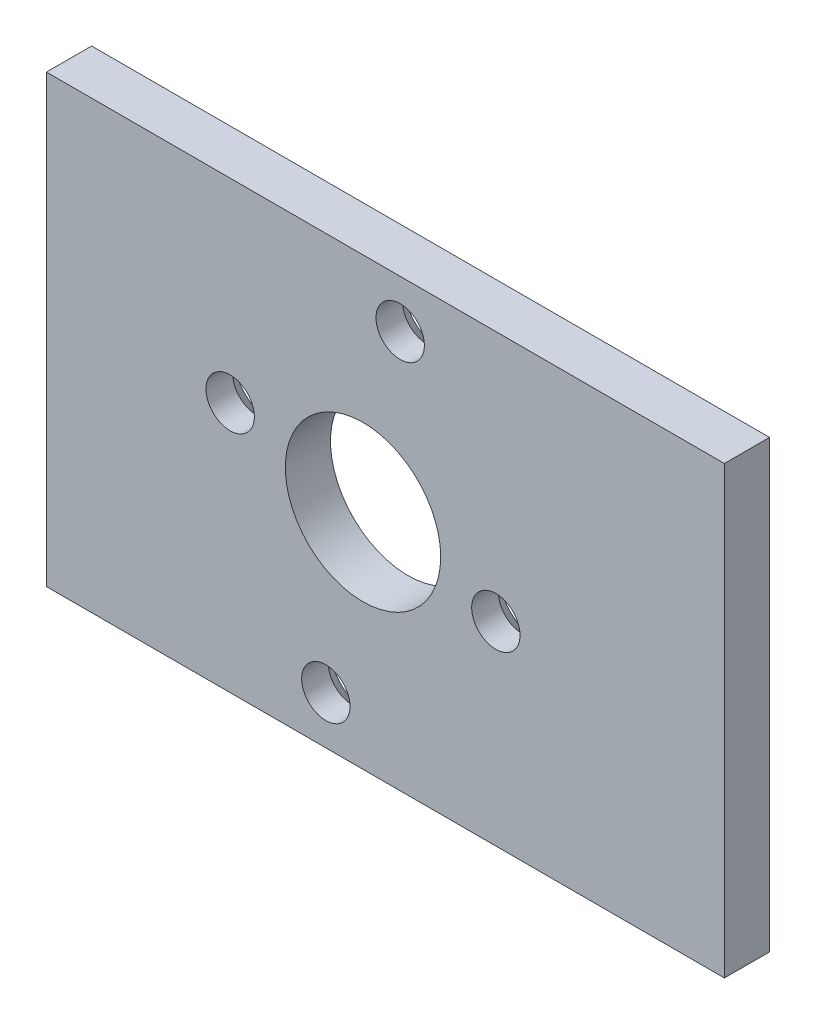
ISO-10303-21;
HEADER;
FILE_DESCRIPTION(('STEP AP214'),'2;1');
FILE_NAME('part.step','',(''),(''),'','','');
FILE_SCHEMA(('AUTOMOTIVE_DESIGN { 1 0 10303 214 1 1 1 1 }'));
ENDSEC;
DATA;
#1=APPLICATION_CONTEXT('core data for automotive mechanical design processes');
#2=APPLICATION_PROTOCOL_DEFINITION('international standard','automotive_design',2000,#1);
#3=PRODUCT_CONTEXT('',#1,'mechanical');
#4=PRODUCT('Part','Part','',(#3));
#5=PRODUCT_RELATED_PRODUCT_CATEGORY('part','',(#4));
#6=PRODUCT_DEFINITION_FORMATION('','',#4);
#7=PRODUCT_DEFINITION_CONTEXT('part definition',#1,'design');
#8=PRODUCT_DEFINITION('design','',#6,#7);
#9=PRODUCT_DEFINITION_SHAPE('','',#8);
#10=(LENGTH_UNIT() NAMED_UNIT(*) SI_UNIT(.MILLI.,.METRE.));
#11=(NAMED_UNIT(*) PLANE_ANGLE_UNIT() SI_UNIT($,.RADIAN.));
#12=(NAMED_UNIT(*) SI_UNIT($,.STERADIAN.) SOLID_ANGLE_UNIT());
#13=UNCERTAINTY_MEASURE_WITH_UNIT(LENGTH_MEASURE(1.E-05),#10,'distance_accuracy_value','');
#14=(GEOMETRIC_REPRESENTATION_CONTEXT(3) GLOBAL_UNCERTAINTY_ASSIGNED_CONTEXT((#13)) GLOBAL_UNIT_ASSIGNED_CONTEXT((#10,
#11,#12)) REPRESENTATION_CONTEXT('',''));
#15=CARTESIAN_POINT('',(0.,0.,0.));
#16=DIRECTION('',(0.,0.,1.));
#17=DIRECTION('',(1.,0.,0.));
#18=AXIS2_PLACEMENT_3D('',#15,#16,#17);
#19=CARTESIAN_POINT('',(25.4,15.6591,3.175));
#20=DIRECTION('',(0.,0.,-1.));
#21=DIRECTION('',(-1.,0.,0.));
#22=AXIS2_PLACEMENT_3D('',#19,#20,#21);
#23=PLANE('',#22);
#24=CARTESIAN_POINT('',(2.61344995357919,12.2953153412239,3.175));
#25=DIRECTION('',(0.,0.,1.));
#26=DIRECTION('',(1.,0.,0.));
#27=AXIS2_PLACEMENT_3D('',#24,#25,#26);
#28=CIRCLE('',#27,1.7);
#29=CARTESIAN_POINT('',(4.31344995357919,12.2953153412239,3.175));
#30=VERTEX_POINT('',#29);
#31=EDGE_CURVE('E155',#30,#30,#28,.T.);
#32=ORIENTED_EDGE('',*,*,#31,.F.);
#33=EDGE_LOOP('',(#32));
#34=FACE_BOUND('',#33,.T.);
#35=CARTESIAN_POINT('',(-9.33641884900418,1.98451708885548,3.175));
#36=DIRECTION('',(0.,0.,1.));
#37=DIRECTION('',(1.,0.,0.));
#38=AXIS2_PLACEMENT_3D('',#35,#36,#37);
#39=CIRCLE('',#38,1.7);
#40=CARTESIAN_POINT('',(-7.63641884900418,1.98451708885548,3.175));
#41=VERTEX_POINT('',#40);
#42=EDGE_CURVE('E158',#41,#41,#39,.T.);
#43=ORIENTED_EDGE('',*,*,#42,.F.);
#44=EDGE_LOOP('',(#43));
#45=FACE_BOUND('',#44,.T.);
#46=DIRECTION('',(0.,1.,0.));
#47=VECTOR('',#46,1.);
#48=CARTESIAN_POINT('',(25.4,-15.6591,3.175));
#49=LINE('',#48,#47);
#50=CARTESIAN_POINT('',(25.4,-15.6591,3.175));
#51=VERTEX_POINT('',#50);
#52=CARTESIAN_POINT('',(25.4,15.6591,3.175));
#53=VERTEX_POINT('',#52);
#54=EDGE_CURVE('E86',#51,#53,#49,.T.);
#55=ORIENTED_EDGE('',*,*,#54,.T.);
#56=DIRECTION('',(-1.,0.,0.));
#57=VECTOR('',#56,1.);
#58=CARTESIAN_POINT('',(-22.2504,15.6591,3.175));
#59=LINE('',#58,#57);
#60=CARTESIAN_POINT('',(-22.2504,15.6591,3.175));
#61=VERTEX_POINT('',#60);
#62=EDGE_CURVE('E81',#53,#61,#59,.T.);
#63=ORIENTED_EDGE('',*,*,#62,.T.);
#64=DIRECTION('',(0.,-1.,0.));
#65=VECTOR('',#64,1.);
#66=CARTESIAN_POINT('',(-22.2504,15.6591,3.175));
#67=LINE('',#66,#65);
#68=CARTESIAN_POINT('',(-22.2504,-15.6591,3.175));
#69=VERTEX_POINT('',#68);
#70=EDGE_CURVE('E84',#61,#69,#67,.T.);
#71=ORIENTED_EDGE('',*,*,#70,.T.);
#72=DIRECTION('',(1.,0.,0.));
#73=VECTOR('',#72,1.);
#74=CARTESIAN_POINT('',(-22.2504,-15.6591,3.175));
#75=LINE('',#74,#73);
#76=EDGE_CURVE('E50',#69,#51,#75,.T.);
#77=ORIENTED_EDGE('',*,*,#76,.T.);
#78=EDGE_LOOP('',(#55,#63,#71,#77));
#79=FACE_BOUND('',#78,.T.);
#80=CARTESIAN_POINT('',(9.33641884900418,-1.98451708885548,3.175));
#81=DIRECTION('',(0.,0.,1.));
#82=DIRECTION('',(1.,0.,0.));
#83=AXIS2_PLACEMENT_3D('',#80,#81,#82);
#84=CIRCLE('',#83,1.7);
#85=CARTESIAN_POINT('',(11.0364188490042,-1.98451708885548,3.175));
#86=VERTEX_POINT('',#85);
#87=EDGE_CURVE('E104',#86,#86,#84,.T.);
#88=ORIENTED_EDGE('',*,*,#87,.F.);
#89=EDGE_LOOP('',(#88));
#90=FACE_BOUND('',#89,.T.);
#91=CARTESIAN_POINT('',(0.,0.,3.175));
#92=DIRECTION('',(0.,0.,1.));
#93=DIRECTION('',(1.,0.,0.));
#94=AXIS2_PLACEMENT_3D('',#91,#92,#93);
#95=CIRCLE('',#94,5.461);
#96=CARTESIAN_POINT('',(5.461,0.,3.175));
#97=VERTEX_POINT('',#96);
#98=EDGE_CURVE('E154',#97,#97,#95,.T.);
#99=ORIENTED_EDGE('',*,*,#98,.F.);
#100=EDGE_LOOP('',(#99));
#101=FACE_BOUND('',#100,.T.);
#102=CARTESIAN_POINT('',(-2.61344995357919,-12.2953153412239,3.175));
#103=DIRECTION('',(0.,0.,1.));
#104=DIRECTION('',(1.,0.,0.));
#105=AXIS2_PLACEMENT_3D('',#102,#103,#104);
#106=CIRCLE('',#105,1.7);
#107=CARTESIAN_POINT('',(-0.913449953579191,-12.2953153412239,3.175));
#108=VERTEX_POINT('',#107);
#109=EDGE_CURVE('E161',#108,#108,#106,.T.);
#110=ORIENTED_EDGE('',*,*,#109,.F.);
#111=EDGE_LOOP('',(#110));
#112=FACE_BOUND('',#111,.T.);
#113=ADVANCED_FACE('F33',(#34,#45,#79,#90,#101,#112),#23,.F.);
#114=CARTESIAN_POINT('',(25.4,15.6591,0.));
#115=DIRECTION('',(0.,0.,-1.));
#116=DIRECTION('',(-1.,0.,0.));
#117=AXIS2_PLACEMENT_3D('',#114,#115,#116);
#118=PLANE('',#117);
#119=CARTESIAN_POINT('',(9.33641884900418,-1.98451708885548,0.));
#120=DIRECTION('',(0.,0.,-1.));
#121=DIRECTION('',(-1.,0.,0.));
#122=AXIS2_PLACEMENT_3D('',#119,#120,#121);
#123=CIRCLE('',#122,2.99999994);
#124=CARTESIAN_POINT('',(6.33641890900419,-1.98451708885548,0.));
#125=VERTEX_POINT('',#124);
#126=EDGE_CURVE('E120',#125,#125,#123,.F.);
#127=ORIENTED_EDGE('',*,*,#126,.T.);
#128=EDGE_LOOP('',(#127));
#129=FACE_BOUND('',#128,.T.);
#130=CARTESIAN_POINT('',(2.61344995357919,12.2953153412239,0.));
#131=DIRECTION('',(0.,0.,-1.));
#132=DIRECTION('',(-1.,0.,0.));
#133=AXIS2_PLACEMENT_3D('',#130,#131,#132);
#134=CIRCLE('',#133,2.99999993999999);
#135=CARTESIAN_POINT('',(-0.386549986420802,12.2953153412239,0.));
#136=VERTEX_POINT('',#135);
#137=EDGE_CURVE('E117',#136,#136,#134,.F.);
#138=ORIENTED_EDGE('',*,*,#137,.T.);
#139=EDGE_LOOP('',(#138));
#140=FACE_BOUND('',#139,.T.);
#141=CARTESIAN_POINT('',(-9.33641884900418,1.98451708885548,0.));
#142=DIRECTION('',(0.,0.,-1.));
#143=DIRECTION('',(-1.,0.,0.));
#144=AXIS2_PLACEMENT_3D('',#141,#142,#143);
#145=CIRCLE('',#144,2.99999994000002);
#146=CARTESIAN_POINT('',(-12.3364187890042,1.98451708885548,0.));
#147=VERTEX_POINT('',#146);
#148=EDGE_CURVE('E114',#147,#147,#145,.F.);
#149=ORIENTED_EDGE('',*,*,#148,.T.);
#150=EDGE_LOOP('',(#149));
#151=FACE_BOUND('',#150,.T.);
#152=CARTESIAN_POINT('',(-2.61344995357919,-12.2953153412239,0.));
#153=DIRECTION('',(0.,0.,-1.));
#154=DIRECTION('',(-1.,0.,0.));
#155=AXIS2_PLACEMENT_3D('',#152,#153,#154);
#156=CIRCLE('',#155,2.99999994);
#157=CARTESIAN_POINT('',(-5.61344989357919,-12.2953153412239,0.));
#158=VERTEX_POINT('',#157);
#159=EDGE_CURVE('E111',#158,#158,#156,.F.);
#160=ORIENTED_EDGE('',*,*,#159,.T.);
#161=EDGE_LOOP('',(#160));
#162=FACE_BOUND('',#161,.T.);
#163=DIRECTION('',(0.,1.,0.));
#164=VECTOR('',#163,1.);
#165=CARTESIAN_POINT('',(25.4,-15.6591,0.));
#166=LINE('',#165,#164);
#167=CARTESIAN_POINT('',(25.4,-15.6591,0.));
#168=VERTEX_POINT('',#167);
#169=CARTESIAN_POINT('',(25.4,15.6591,0.));
#170=VERTEX_POINT('',#169);
#171=EDGE_CURVE('E101',#168,#170,#166,.T.);
#172=ORIENTED_EDGE('',*,*,#171,.F.);
#173=DIRECTION('',(1.,0.,0.));
#174=VECTOR('',#173,1.);
#175=CARTESIAN_POINT('',(-22.2504,-15.6591,0.));
#176=LINE('',#175,#174);
#177=CARTESIAN_POINT('',(-22.2504,-15.6591,0.));
#178=VERTEX_POINT('',#177);
#179=EDGE_CURVE('E73',#178,#168,#176,.T.);
#180=ORIENTED_EDGE('',*,*,#179,.F.);
#181=DIRECTION('',(0.,-1.,0.));
#182=VECTOR('',#181,1.);
#183=CARTESIAN_POINT('',(-22.2504,15.6591,0.));
#184=LINE('',#183,#182);
#185=CARTESIAN_POINT('',(-22.2504,15.6591,0.));
#186=VERTEX_POINT('',#185);
#187=EDGE_CURVE('E67',#186,#178,#184,.T.);
#188=ORIENTED_EDGE('',*,*,#187,.F.);
#189=DIRECTION('',(-1.,0.,0.));
#190=VECTOR('',#189,1.);
#191=CARTESIAN_POINT('',(-22.2504,15.6591,0.));
#192=LINE('',#191,#190);
#193=EDGE_CURVE('E91',#170,#186,#192,.T.);
#194=ORIENTED_EDGE('',*,*,#193,.F.);
#195=EDGE_LOOP('',(#172,#180,#188,#194));
#196=FACE_BOUND('',#195,.T.);
#197=CARTESIAN_POINT('',(0.,0.,0.));
#198=DIRECTION('',(0.,0.,1.));
#199=DIRECTION('',(1.,0.,0.));
#200=AXIS2_PLACEMENT_3D('',#197,#198,#199);
#201=CIRCLE('',#200,5.461);
#202=CARTESIAN_POINT('',(5.461,0.,0.));
#203=VERTEX_POINT('',#202);
#204=EDGE_CURVE('E152',#203,#203,#201,.T.);
#205=ORIENTED_EDGE('',*,*,#204,.T.);
#206=EDGE_LOOP('',(#205));
#207=FACE_BOUND('',#206,.T.);
#208=ADVANCED_FACE('F140',(#129,#140,#151,#162,#196,#207),#118,.T.);
#209=CARTESIAN_POINT('',(25.4,-15.6591,3.175));
#210=DIRECTION('',(-1.,0.,0.));
#211=DIRECTION('',(0.,0.,1.));
#212=AXIS2_PLACEMENT_3D('',#209,#210,#211);
#213=PLANE('',#212);
#214=ORIENTED_EDGE('',*,*,#171,.T.);
#215=DIRECTION('',(0.,0.,-1.));
#216=VECTOR('',#215,1.);
#217=CARTESIAN_POINT('',(25.4,15.6591,3.175));
#218=LINE('',#217,#216);
#219=EDGE_CURVE('E92',#53,#170,#218,.T.);
#220=ORIENTED_EDGE('',*,*,#219,.F.);
#221=ORIENTED_EDGE('',*,*,#54,.F.);
#222=DIRECTION('',(0.,0.,-1.));
#223=VECTOR('',#222,1.);
#224=CARTESIAN_POINT('',(25.4,-15.6591,3.175));
#225=LINE('',#224,#223);
#226=EDGE_CURVE('E97',#51,#168,#225,.T.);
#227=ORIENTED_EDGE('',*,*,#226,.T.);
#228=EDGE_LOOP('',(#214,#220,#221,#227));
#229=FACE_BOUND('',#228,.T.);
#230=ADVANCED_FACE('F143',(#229),#213,.F.);
#231=CARTESIAN_POINT('',(-22.2504,15.6591,3.175));
#232=DIRECTION('',(0.,-1.,0.));
#233=DIRECTION('',(0.,0.,-1.));
#234=AXIS2_PLACEMENT_3D('',#231,#232,#233);
#235=PLANE('',#234);
#236=ORIENTED_EDGE('',*,*,#193,.T.);
#237=DIRECTION('',(0.,0.,-1.));
#238=VECTOR('',#237,1.);
#239=CARTESIAN_POINT('',(-22.2504,15.6591,3.175));
#240=LINE('',#239,#238);
#241=EDGE_CURVE('E89',#61,#186,#240,.T.);
#242=ORIENTED_EDGE('',*,*,#241,.F.);
#243=ORIENTED_EDGE('',*,*,#62,.F.);
#244=ORIENTED_EDGE('',*,*,#219,.T.);
#245=EDGE_LOOP('',(#236,#242,#243,#244));
#246=FACE_BOUND('',#245,.T.);
#247=ADVANCED_FACE('F90',(#246),#235,.F.);
#248=CARTESIAN_POINT('',(-22.2504,15.6591,3.175));
#249=DIRECTION('',(1.,0.,0.));
#250=DIRECTION('',(0.,1.,0.));
#251=AXIS2_PLACEMENT_3D('',#248,#249,#250);
#252=PLANE('',#251);
#253=ORIENTED_EDGE('',*,*,#187,.T.);
#254=DIRECTION('',(0.,0.,-1.));
#255=VECTOR('',#254,1.);
#256=CARTESIAN_POINT('',(-22.2504,-15.6591,3.175));
#257=LINE('',#256,#255);
#258=EDGE_CURVE('E93',#69,#178,#257,.T.);
#259=ORIENTED_EDGE('',*,*,#258,.F.);
#260=ORIENTED_EDGE('',*,*,#70,.F.);
#261=ORIENTED_EDGE('',*,*,#241,.T.);
#262=EDGE_LOOP('',(#253,#259,#260,#261));
#263=FACE_BOUND('',#262,.T.);
#264=ADVANCED_FACE('F95',(#263),#252,.F.);
#265=CARTESIAN_POINT('',(-22.2504,-15.6591,3.175));
#266=DIRECTION('',(0.,1.,0.));
#267=DIRECTION('',(0.,0.,1.));
#268=AXIS2_PLACEMENT_3D('',#265,#266,#267);
#269=PLANE('',#268);
#270=ORIENTED_EDGE('',*,*,#179,.T.);
#271=ORIENTED_EDGE('',*,*,#226,.F.);
#272=ORIENTED_EDGE('',*,*,#76,.F.);
#273=ORIENTED_EDGE('',*,*,#258,.T.);
#274=EDGE_LOOP('',(#270,#271,#272,#273));
#275=FACE_BOUND('',#274,.T.);
#276=ADVANCED_FACE('F202',(#275),#269,.F.);
#277=CARTESIAN_POINT('',(9.33641884900418,-1.98451708885548,3.175));
#278=DIRECTION('',(0.,0.,-1.));
#279=DIRECTION('',(-1.,0.,0.));
#280=AXIS2_PLACEMENT_3D('',#277,#278,#279);
#281=CYLINDRICAL_SURFACE('',#280,1.7);
#282=CARTESIAN_POINT('',(9.33641884900418,-1.98451708885548,1.29999994000001));
#283=DIRECTION('',(0.,0.,-1.));
#284=DIRECTION('',(-1.,0.,0.));
#285=AXIS2_PLACEMENT_3D('',#282,#283,#284);
#286=CIRCLE('',#285,1.7);
#287=CARTESIAN_POINT('',(7.63641884900418,-1.98451708885548,1.29999994000001));
#288=VERTEX_POINT('',#287);
#289=EDGE_CURVE('E123',#288,#288,#286,.T.);
#290=ORIENTED_EDGE('',*,*,#289,.T.);
#291=EDGE_LOOP('',(#290));
#292=FACE_BOUND('',#291,.T.);
#293=ORIENTED_EDGE('',*,*,#87,.T.);
#294=EDGE_LOOP('',(#293));
#295=FACE_BOUND('',#294,.T.);
#296=ADVANCED_FACE('F169',(#292,#295),#281,.F.);
#297=CARTESIAN_POINT('',(-9.33641884900418,1.98451708885548,3.175));
#298=DIRECTION('',(0.,0.,-1.));
#299=DIRECTION('',(-1.,0.,0.));
#300=AXIS2_PLACEMENT_3D('',#297,#298,#299);
#301=CYLINDRICAL_SURFACE('',#300,1.7);
#302=CARTESIAN_POINT('',(-9.33641884900418,1.98451708885548,1.29999994000002));
#303=DIRECTION('',(0.,0.,-1.));
#304=DIRECTION('',(-1.,0.,0.));
#305=AXIS2_PLACEMENT_3D('',#302,#303,#304);
#306=CIRCLE('',#305,1.7);
#307=CARTESIAN_POINT('',(-11.0364188490042,1.98451708885548,1.29999994000002));
#308=VERTEX_POINT('',#307);
#309=EDGE_CURVE('E42',#308,#308,#306,.T.);
#310=ORIENTED_EDGE('',*,*,#309,.T.);
#311=EDGE_LOOP('',(#310));
#312=FACE_BOUND('',#311,.T.);
#313=ORIENTED_EDGE('',*,*,#42,.T.);
#314=EDGE_LOOP('',(#313));
#315=FACE_BOUND('',#314,.T.);
#316=ADVANCED_FACE('F131',(#312,#315),#301,.F.);
#317=CARTESIAN_POINT('',(0.,0.,3.175));
#318=DIRECTION('',(0.,0.,-1.));
#319=DIRECTION('',(-1.,0.,0.));
#320=AXIS2_PLACEMENT_3D('',#317,#318,#319);
#321=CYLINDRICAL_SURFACE('',#320,5.461);
#322=ORIENTED_EDGE('',*,*,#98,.T.);
#323=EDGE_LOOP('',(#322));
#324=FACE_BOUND('',#323,.T.);
#325=ORIENTED_EDGE('',*,*,#204,.F.);
#326=EDGE_LOOP('',(#325));
#327=FACE_BOUND('',#326,.T.);
#328=ADVANCED_FACE('F192',(#324,#327),#321,.F.);
#329=CARTESIAN_POINT('',(2.61344995357919,12.2953153412239,3.175));
#330=DIRECTION('',(0.,0.,-1.));
#331=DIRECTION('',(-1.,0.,0.));
#332=AXIS2_PLACEMENT_3D('',#329,#330,#331);
#333=CYLINDRICAL_SURFACE('',#332,1.7);
#334=CARTESIAN_POINT('',(2.61344995357919,12.2953153412239,1.29999994));
#335=DIRECTION('',(0.,0.,-1.));
#336=DIRECTION('',(-1.,0.,0.));
#337=AXIS2_PLACEMENT_3D('',#334,#335,#336);
#338=CIRCLE('',#337,1.7);
#339=CARTESIAN_POINT('',(0.913449953579189,12.2953153412239,1.29999994));
#340=VERTEX_POINT('',#339);
#341=EDGE_CURVE('E126',#340,#340,#338,.T.);
#342=ORIENTED_EDGE('',*,*,#341,.T.);
#343=EDGE_LOOP('',(#342));
#344=FACE_BOUND('',#343,.T.);
#345=ORIENTED_EDGE('',*,*,#31,.T.);
#346=EDGE_LOOP('',(#345));
#347=FACE_BOUND('',#346,.T.);
#348=ADVANCED_FACE('F183',(#344,#347),#333,.F.);
#349=CARTESIAN_POINT('',(-2.61344995357919,-12.2953153412239,3.175));
#350=DIRECTION('',(0.,0.,-1.));
#351=DIRECTION('',(-1.,0.,0.));
#352=AXIS2_PLACEMENT_3D('',#349,#350,#351);
#353=CYLINDRICAL_SURFACE('',#352,1.7);
#354=CARTESIAN_POINT('',(-2.61344995357919,-12.2953153412239,1.29999994));
#355=DIRECTION('',(0.,0.,-1.));
#356=DIRECTION('',(-1.,0.,0.));
#357=AXIS2_PLACEMENT_3D('',#354,#355,#356);
#358=CIRCLE('',#357,1.7);
#359=CARTESIAN_POINT('',(-4.31344995357919,-12.2953153412239,1.29999994));
#360=VERTEX_POINT('',#359);
#361=EDGE_CURVE('E11',#360,#360,#358,.T.);
#362=ORIENTED_EDGE('',*,*,#361,.T.);
#363=EDGE_LOOP('',(#362));
#364=FACE_BOUND('',#363,.T.);
#365=ORIENTED_EDGE('',*,*,#109,.T.);
#366=EDGE_LOOP('',(#365));
#367=FACE_BOUND('',#366,.T.);
#368=ADVANCED_FACE('F180',(#364,#367),#353,.F.);
#369=CARTESIAN_POINT('',(9.33641884900418,-1.98451708885548,0.));
#370=DIRECTION('',(0.,0.,-1.));
#371=DIRECTION('',(-1.,0.,0.));
#372=AXIS2_PLACEMENT_3D('',#369,#370,#371);
#373=CONICAL_SURFACE('',#372,2.99999994,0.785398163397445);
#374=ORIENTED_EDGE('',*,*,#289,.F.);
#375=EDGE_LOOP('',(#374));
#376=FACE_BOUND('',#375,.T.);
#377=ORIENTED_EDGE('',*,*,#126,.F.);
#378=EDGE_LOOP('',(#377));
#379=FACE_BOUND('',#378,.T.);
#380=ADVANCED_FACE('F182',(#376,#379),#373,.F.);
#381=CARTESIAN_POINT('',(2.61344995357919,12.2953153412239,0.));
#382=DIRECTION('',(0.,0.,-1.));
#383=DIRECTION('',(-1.,0.,0.));
#384=AXIS2_PLACEMENT_3D('',#381,#382,#383);
#385=CONICAL_SURFACE('',#384,2.99999993999999,0.785398163397445);
#386=ORIENTED_EDGE('',*,*,#341,.F.);
#387=EDGE_LOOP('',(#386));
#388=FACE_BOUND('',#387,.T.);
#389=ORIENTED_EDGE('',*,*,#137,.F.);
#390=EDGE_LOOP('',(#389));
#391=FACE_BOUND('',#390,.T.);
#392=ADVANCED_FACE('F137',(#388,#391),#385,.F.);
#393=CARTESIAN_POINT('',(-9.33641884900418,1.98451708885548,0.));
#394=DIRECTION('',(0.,0.,-1.));
#395=DIRECTION('',(-1.,0.,0.));
#396=AXIS2_PLACEMENT_3D('',#393,#394,#395);
#397=CONICAL_SURFACE('',#396,2.99999994000002,0.785398163397446);
#398=ORIENTED_EDGE('',*,*,#309,.F.);
#399=EDGE_LOOP('',(#398));
#400=FACE_BOUND('',#399,.T.);
#401=ORIENTED_EDGE('',*,*,#148,.F.);
#402=EDGE_LOOP('',(#401));
#403=FACE_BOUND('',#402,.T.);
#404=ADVANCED_FACE('F134',(#400,#403),#397,.F.);
#405=CARTESIAN_POINT('',(-2.61344995357919,-12.2953153412239,0.));
#406=DIRECTION('',(0.,0.,-1.));
#407=DIRECTION('',(-1.,0.,0.));
#408=AXIS2_PLACEMENT_3D('',#405,#406,#407);
#409=CONICAL_SURFACE('',#408,2.99999994,0.785398163397445);
#410=ORIENTED_EDGE('',*,*,#361,.F.);
#411=EDGE_LOOP('',(#410));
#412=FACE_BOUND('',#411,.T.);
#413=ORIENTED_EDGE('',*,*,#159,.F.);
#414=EDGE_LOOP('',(#413));
#415=FACE_BOUND('',#414,.T.);
#416=ADVANCED_FACE('F35',(#412,#415),#409,.F.);
#417=CLOSED_SHELL('',(#113,#208,#230,#247,#264,#276,#296,#316,#328,#348,#368,#380,#392,#404,#416));
#418=MANIFOLD_SOLID_BREP('B2',#417);
#419=ADVANCED_BREP_SHAPE_REPRESENTATION('',(#18,#418),#14);
#420=SHAPE_DEFINITION_REPRESENTATION(#9,#419);
ENDSEC;
END-ISO-10303-21;
